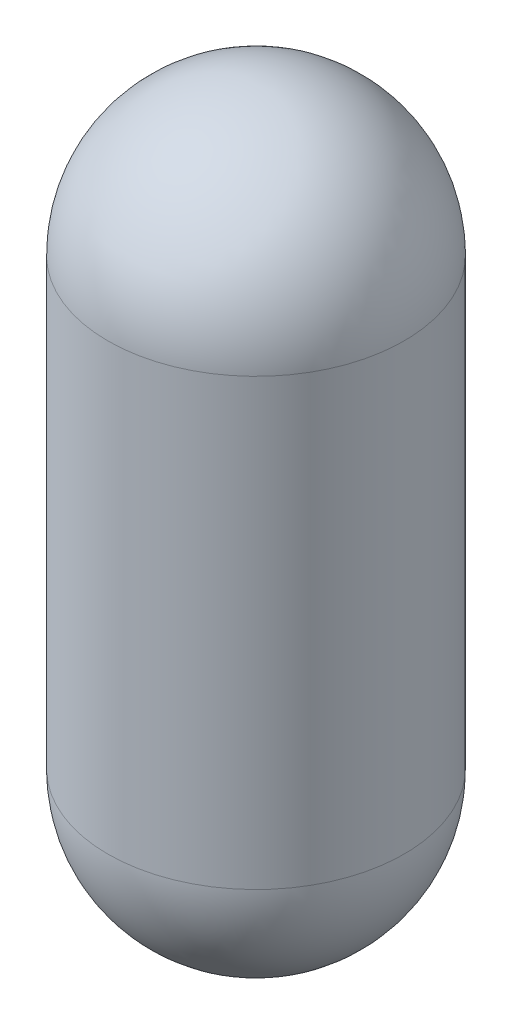
ISO-10303-21;
HEADER;
FILE_DESCRIPTION(('STEP AP214'),'2;1');
FILE_NAME('part.step','',(''),(''),'','','');
FILE_SCHEMA(('AUTOMOTIVE_DESIGN { 1 0 10303 214 1 1 1 1 }'));
ENDSEC;
DATA;
#1=APPLICATION_CONTEXT('core data for automotive mechanical design processes');
#2=APPLICATION_PROTOCOL_DEFINITION('international standard','automotive_design',2000,#1);
#3=PRODUCT_CONTEXT('',#1,'mechanical');
#4=PRODUCT('Part','Part','',(#3));
#5=PRODUCT_RELATED_PRODUCT_CATEGORY('part','',(#4));
#6=PRODUCT_DEFINITION_FORMATION('','',#4);
#7=PRODUCT_DEFINITION_CONTEXT('part definition',#1,'design');
#8=PRODUCT_DEFINITION('design','',#6,#7);
#9=PRODUCT_DEFINITION_SHAPE('','',#8);
#10=(LENGTH_UNIT() NAMED_UNIT(*) SI_UNIT(.MILLI.,.METRE.));
#11=(NAMED_UNIT(*) PLANE_ANGLE_UNIT() SI_UNIT($,.RADIAN.));
#12=(NAMED_UNIT(*) SI_UNIT($,.STERADIAN.) SOLID_ANGLE_UNIT());
#13=UNCERTAINTY_MEASURE_WITH_UNIT(LENGTH_MEASURE(1.E-05),#10,'distance_accuracy_value','');
#14=(GEOMETRIC_REPRESENTATION_CONTEXT(3) GLOBAL_UNCERTAINTY_ASSIGNED_CONTEXT((#13)) GLOBAL_UNIT_ASSIGNED_CONTEXT((#10,
#11,#12)) REPRESENTATION_CONTEXT('',''));
#15=CARTESIAN_POINT('',(0.,0.,0.));
#16=DIRECTION('',(0.,0.,1.));
#17=DIRECTION('',(1.,0.,0.));
#18=AXIS2_PLACEMENT_3D('',#15,#16,#17);
#19=CARTESIAN_POINT('',(0.,127.,0.));
#20=DIRECTION('',(0.,-1.,0.));
#21=DIRECTION('',(0.,0.,-1.));
#22=AXIS2_PLACEMENT_3D('',#19,#20,#21);
#23=CYLINDRICAL_SURFACE('',#22,25.4);
#24=CARTESIAN_POINT('',(0.,25.4,0.));
#25=DIRECTION('',(0.,-1.,0.));
#26=DIRECTION('',(0.,0.,-1.));
#27=AXIS2_PLACEMENT_3D('',#24,#25,#26);
#28=CIRCLE('',#27,25.4);
#29=CARTESIAN_POINT('',(0.,25.4,-25.4));
#30=VERTEX_POINT('',#29);
#31=EDGE_CURVE('E10',#30,#30,#28,.F.);
#32=ORIENTED_EDGE('',*,*,#31,.T.);
#33=EDGE_LOOP('',(#32));
#34=FACE_BOUND('',#33,.T.);
#35=CARTESIAN_POINT('',(0.,101.6,0.));
#36=DIRECTION('',(0.,-1.,0.));
#37=DIRECTION('',(0.,0.,-1.));
#38=AXIS2_PLACEMENT_3D('',#35,#36,#37);
#39=CIRCLE('',#38,25.4);
#40=CARTESIAN_POINT('',(0.,101.6,-25.4));
#41=VERTEX_POINT('',#40);
#42=EDGE_CURVE('E46',#41,#41,#39,.T.);
#43=ORIENTED_EDGE('',*,*,#42,.T.);
#44=EDGE_LOOP('',(#43));
#45=FACE_BOUND('',#44,.T.);
#46=ADVANCED_FACE('F38',(#34,#45),#23,.T.);
#47=CARTESIAN_POINT('',(0.,25.4,0.));
#48=DIRECTION('',(0.,1.,0.));
#49=DIRECTION('',(0.,0.,1.));
#50=AXIS2_PLACEMENT_3D('',#47,#48,#49);
#51=SPHERICAL_SURFACE('',#50,25.4);
#52=ORIENTED_EDGE('',*,*,#31,.F.);
#53=EDGE_LOOP('',(#52));
#54=FACE_BOUND('',#53,.T.);
#55=ADVANCED_FACE('F55',(#54),#51,.T.);
#56=CARTESIAN_POINT('',(0.,101.6,0.));
#57=DIRECTION('',(0.,1.,0.));
#58=DIRECTION('',(0.,0.,1.));
#59=AXIS2_PLACEMENT_3D('',#56,#57,#58);
#60=SPHERICAL_SURFACE('',#59,25.4);
#61=ORIENTED_EDGE('',*,*,#42,.F.);
#62=EDGE_LOOP('',(#61));
#63=FACE_BOUND('',#62,.T.);
#64=ADVANCED_FACE('F40',(#63),#60,.T.);
#65=CLOSED_SHELL('',(#46,#55,#64));
#66=MANIFOLD_SOLID_BREP('B2',#65);
#67=ADVANCED_BREP_SHAPE_REPRESENTATION('',(#18,#66),#14);
#68=SHAPE_DEFINITION_REPRESENTATION(#9,#67);
ENDSEC;
END-ISO-10303-21;
